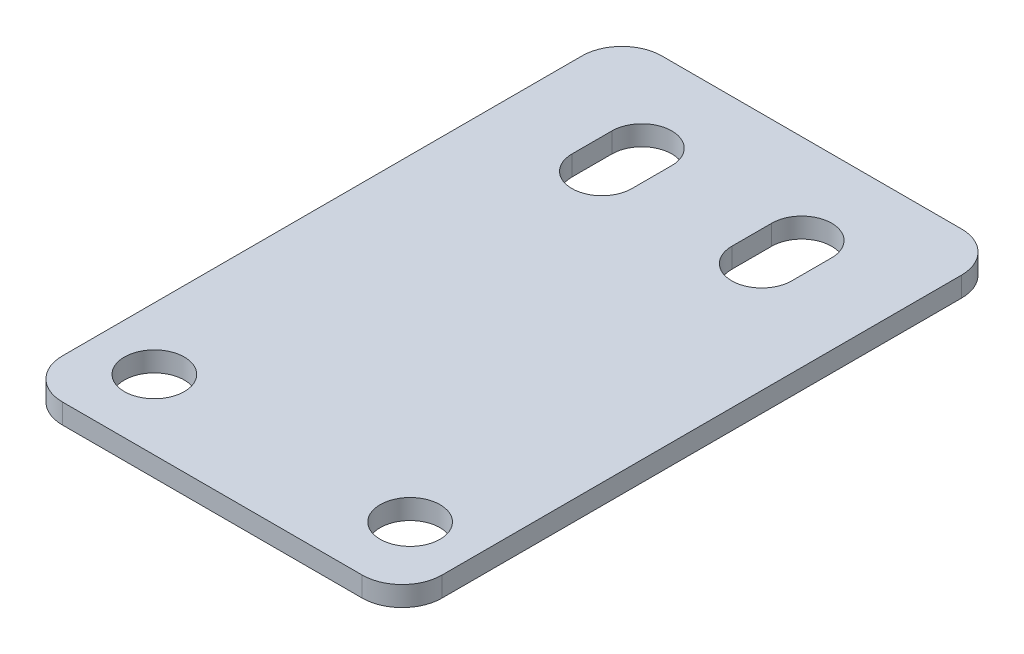
ISO-10303-21;
HEADER;
FILE_DESCRIPTION(('STEP AP214'),'2;1');
FILE_NAME('part.step','',(''),(''),'','','');
FILE_SCHEMA(('AUTOMOTIVE_DESIGN { 1 0 10303 214 1 1 1 1 }'));
ENDSEC;
DATA;
#1=APPLICATION_CONTEXT('core data for automotive mechanical design processes');
#2=APPLICATION_PROTOCOL_DEFINITION('international standard','automotive_design',2000,#1);
#3=PRODUCT_CONTEXT('',#1,'mechanical');
#4=PRODUCT('Part','Part','',(#3));
#5=PRODUCT_RELATED_PRODUCT_CATEGORY('part','',(#4));
#6=PRODUCT_DEFINITION_FORMATION('','',#4);
#7=PRODUCT_DEFINITION_CONTEXT('part definition',#1,'design');
#8=PRODUCT_DEFINITION('design','',#6,#7);
#9=PRODUCT_DEFINITION_SHAPE('','',#8);
#10=(LENGTH_UNIT() NAMED_UNIT(*) SI_UNIT(.MILLI.,.METRE.));
#11=(NAMED_UNIT(*) PLANE_ANGLE_UNIT() SI_UNIT($,.RADIAN.));
#12=(NAMED_UNIT(*) SI_UNIT($,.STERADIAN.) SOLID_ANGLE_UNIT());
#13=UNCERTAINTY_MEASURE_WITH_UNIT(LENGTH_MEASURE(1.E-05),#10,'distance_accuracy_value','');
#14=(GEOMETRIC_REPRESENTATION_CONTEXT(3) GLOBAL_UNCERTAINTY_ASSIGNED_CONTEXT((#13)) GLOBAL_UNIT_ASSIGNED_CONTEXT((#10,
#11,#12)) REPRESENTATION_CONTEXT('',''));
#15=CARTESIAN_POINT('',(0.,0.,0.));
#16=DIRECTION('',(0.,0.,1.));
#17=DIRECTION('',(1.,0.,0.));
#18=AXIS2_PLACEMENT_3D('',#15,#16,#17);
#19=CARTESIAN_POINT('',(9.50000000000001,-1.,-26.5));
#20=DIRECTION('',(0.,0.,-1.));
#21=DIRECTION('',(-1.,0.,0.));
#22=AXIS2_PLACEMENT_3D('',#19,#20,#21);
#23=PLANE('',#22);
#24=DIRECTION('',(-1.,0.,0.));
#25=VECTOR('',#24,1.);
#26=CARTESIAN_POINT('',(9.50000000000001,0.,-26.5));
#27=LINE('',#26,#25);
#28=CARTESIAN_POINT('',(7.50000000000001,0.,-26.5));
#29=VERTEX_POINT('',#28);
#30=CARTESIAN_POINT('',(-7.5,0.,-26.5));
#31=VERTEX_POINT('',#30);
#32=EDGE_CURVE('E237',#29,#31,#27,.T.);
#33=ORIENTED_EDGE('',*,*,#32,.F.);
#34=DIRECTION('',(0.,1.,0.));
#35=VECTOR('',#34,1.);
#36=CARTESIAN_POINT('',(7.50000000000001,-1.,-26.5));
#37=LINE('',#36,#35);
#38=CARTESIAN_POINT('',(7.50000000000001,-1.,-26.5));
#39=VERTEX_POINT('',#38);
#40=EDGE_CURVE('E11',#29,#39,#37,.F.);
#41=ORIENTED_EDGE('',*,*,#40,.T.);
#42=DIRECTION('',(-1.,0.,0.));
#43=VECTOR('',#42,1.);
#44=CARTESIAN_POINT('',(9.50000000000001,-1.,-26.5));
#45=LINE('',#44,#43);
#46=CARTESIAN_POINT('',(-7.5,-1.,-26.5));
#47=VERTEX_POINT('',#46);
#48=EDGE_CURVE('E240',#39,#47,#45,.T.);
#49=ORIENTED_EDGE('',*,*,#48,.T.);
#50=DIRECTION('',(0.,1.,0.));
#51=VECTOR('',#50,1.);
#52=CARTESIAN_POINT('',(-7.5,-1.,-26.5));
#53=LINE('',#52,#51);
#54=EDGE_CURVE('E46',#47,#31,#53,.T.);
#55=ORIENTED_EDGE('',*,*,#54,.T.);
#56=EDGE_LOOP('',(#33,#41,#49,#55));
#57=FACE_BOUND('',#56,.T.);
#58=ADVANCED_FACE('F38',(#57),#23,.T.);
#59=CARTESIAN_POINT('',(9.50000000000001,-1.,3.5));
#60=DIRECTION('',(1.,0.,0.));
#61=DIRECTION('',(0.,0.,-1.));
#62=AXIS2_PLACEMENT_3D('',#59,#60,#61);
#63=PLANE('',#62);
#64=DIRECTION('',(0.,0.,-1.));
#65=VECTOR('',#64,1.);
#66=CARTESIAN_POINT('',(9.50000000000001,0.,3.5));
#67=LINE('',#66,#65);
#68=CARTESIAN_POINT('',(9.50000000000001,0.,1.5));
#69=VERTEX_POINT('',#68);
#70=CARTESIAN_POINT('',(9.50000000000001,0.,-24.5));
#71=VERTEX_POINT('',#70);
#72=EDGE_CURVE('E244',#69,#71,#67,.T.);
#73=ORIENTED_EDGE('',*,*,#72,.F.);
#74=DIRECTION('',(0.,1.,0.));
#75=VECTOR('',#74,1.);
#76=CARTESIAN_POINT('',(9.50000000000001,-1.,1.5));
#77=LINE('',#76,#75);
#78=CARTESIAN_POINT('',(9.50000000000001,-1.,1.5));
#79=VERTEX_POINT('',#78);
#80=EDGE_CURVE('E60',#69,#79,#77,.F.);
#81=ORIENTED_EDGE('',*,*,#80,.T.);
#82=DIRECTION('',(0.,0.,-1.));
#83=VECTOR('',#82,1.);
#84=CARTESIAN_POINT('',(9.50000000000001,-1.,3.5));
#85=LINE('',#84,#83);
#86=CARTESIAN_POINT('',(9.50000000000001,-1.,-24.5));
#87=VERTEX_POINT('',#86);
#88=EDGE_CURVE('E250',#79,#87,#85,.T.);
#89=ORIENTED_EDGE('',*,*,#88,.T.);
#90=DIRECTION('',(0.,1.,0.));
#91=VECTOR('',#90,1.);
#92=CARTESIAN_POINT('',(9.50000000000001,-1.,-24.5));
#93=LINE('',#92,#91);
#94=EDGE_CURVE('E287',#87,#71,#93,.T.);
#95=ORIENTED_EDGE('',*,*,#94,.T.);
#96=EDGE_LOOP('',(#73,#81,#89,#95));
#97=FACE_BOUND('',#96,.T.);
#98=ADVANCED_FACE('F303',(#97),#63,.T.);
#99=CARTESIAN_POINT('',(-9.49999999999999,-1.,3.5));
#100=DIRECTION('',(0.,0.,1.));
#101=DIRECTION('',(1.,0.,0.));
#102=AXIS2_PLACEMENT_3D('',#99,#100,#101);
#103=PLANE('',#102);
#104=DIRECTION('',(1.,0.,0.));
#105=VECTOR('',#104,1.);
#106=CARTESIAN_POINT('',(-9.49999999999999,0.,3.5));
#107=LINE('',#106,#105);
#108=CARTESIAN_POINT('',(-7.49999999999999,0.,3.5));
#109=VERTEX_POINT('',#108);
#110=CARTESIAN_POINT('',(7.50000000000001,0.,3.5));
#111=VERTEX_POINT('',#110);
#112=EDGE_CURVE('E258',#109,#111,#107,.T.);
#113=ORIENTED_EDGE('',*,*,#112,.F.);
#114=DIRECTION('',(0.,1.,0.));
#115=VECTOR('',#114,1.);
#116=CARTESIAN_POINT('',(-7.49999999999999,-1.,3.5));
#117=LINE('',#116,#115);
#118=CARTESIAN_POINT('',(-7.49999999999999,-1.,3.5));
#119=VERTEX_POINT('',#118);
#120=EDGE_CURVE('E278',#109,#119,#117,.F.);
#121=ORIENTED_EDGE('',*,*,#120,.T.);
#122=DIRECTION('',(1.,0.,0.));
#123=VECTOR('',#122,1.);
#124=CARTESIAN_POINT('',(-9.49999999999999,-1.,3.5));
#125=LINE('',#124,#123);
#126=CARTESIAN_POINT('',(7.50000000000001,-1.,3.5));
#127=VERTEX_POINT('',#126);
#128=EDGE_CURVE('E247',#119,#127,#125,.T.);
#129=ORIENTED_EDGE('',*,*,#128,.T.);
#130=DIRECTION('',(0.,1.,0.));
#131=VECTOR('',#130,1.);
#132=CARTESIAN_POINT('',(7.50000000000001,-1.,3.5));
#133=LINE('',#132,#131);
#134=EDGE_CURVE('E275',#127,#111,#133,.T.);
#135=ORIENTED_EDGE('',*,*,#134,.T.);
#136=EDGE_LOOP('',(#113,#121,#129,#135));
#137=FACE_BOUND('',#136,.T.);
#138=ADVANCED_FACE('F311',(#137),#103,.T.);
#139=CARTESIAN_POINT('',(-9.5,-1.,-26.5));
#140=DIRECTION('',(-1.,0.,0.));
#141=DIRECTION('',(0.,0.,1.));
#142=AXIS2_PLACEMENT_3D('',#139,#140,#141);
#143=PLANE('',#142);
#144=DIRECTION('',(0.,0.,1.));
#145=VECTOR('',#144,1.);
#146=CARTESIAN_POINT('',(-9.5,-1.,-26.5));
#147=LINE('',#146,#145);
#148=CARTESIAN_POINT('',(-9.5,-1.,-24.5));
#149=VERTEX_POINT('',#148);
#150=CARTESIAN_POINT('',(-9.49999999999999,-1.,1.49999999999999));
#151=VERTEX_POINT('',#150);
#152=EDGE_CURVE('E243',#149,#151,#147,.T.);
#153=ORIENTED_EDGE('',*,*,#152,.T.);
#154=DIRECTION('',(0.,1.,0.));
#155=VECTOR('',#154,1.);
#156=CARTESIAN_POINT('',(-9.49999999999999,-1.,1.5));
#157=LINE('',#156,#155);
#158=CARTESIAN_POINT('',(-9.49999999999999,0.,1.49999999999999));
#159=VERTEX_POINT('',#158);
#160=EDGE_CURVE('E264',#151,#159,#157,.T.);
#161=ORIENTED_EDGE('',*,*,#160,.T.);
#162=DIRECTION('',(0.,0.,1.));
#163=VECTOR('',#162,1.);
#164=CARTESIAN_POINT('',(-9.5,0.,-26.5));
#165=LINE('',#164,#163);
#166=CARTESIAN_POINT('',(-9.5,0.,-24.5));
#167=VERTEX_POINT('',#166);
#168=EDGE_CURVE('E255',#167,#159,#165,.T.);
#169=ORIENTED_EDGE('',*,*,#168,.F.);
#170=DIRECTION('',(0.,1.,0.));
#171=VECTOR('',#170,1.);
#172=CARTESIAN_POINT('',(-9.5,-1.,-24.5));
#173=LINE('',#172,#171);
#174=EDGE_CURVE('E252',#167,#149,#173,.F.);
#175=ORIENTED_EDGE('',*,*,#174,.T.);
#176=EDGE_LOOP('',(#153,#161,#169,#175));
#177=FACE_BOUND('',#176,.T.);
#178=ADVANCED_FACE('F318',(#177),#143,.T.);
#179=CARTESIAN_POINT('',(0.,-1.,0.));
#180=DIRECTION('',(0.,1.,0.));
#181=DIRECTION('',(0.,0.,1.));
#182=AXIS2_PLACEMENT_3D('',#179,#180,#181);
#183=PLANE('',#182);
#184=DIRECTION('',(0.,0.,-1.));
#185=VECTOR('',#184,1.);
#186=CARTESIAN_POINT('',(5.5,-1.,-22.));
#187=LINE('',#186,#185);
#188=CARTESIAN_POINT('',(5.5,-1.,-20.));
#189=VERTEX_POINT('',#188);
#190=CARTESIAN_POINT('',(5.5,-1.,-22.));
#191=VERTEX_POINT('',#190);
#192=EDGE_CURVE('E164',#189,#191,#187,.T.);
#193=ORIENTED_EDGE('',*,*,#192,.T.);
#194=CARTESIAN_POINT('',(4.,-1.,-22.));
#195=DIRECTION('',(0.,1.,0.));
#196=DIRECTION('',(0.,0.,1.));
#197=AXIS2_PLACEMENT_3D('',#194,#195,#196);
#198=CIRCLE('',#197,1.5);
#199=CARTESIAN_POINT('',(2.5,-1.,-22.));
#200=VERTEX_POINT('',#199);
#201=EDGE_CURVE('E156',#191,#200,#198,.T.);
#202=ORIENTED_EDGE('',*,*,#201,.T.);
#203=DIRECTION('',(0.,0.,1.));
#204=VECTOR('',#203,1.);
#205=CARTESIAN_POINT('',(2.5,-1.,-22.));
#206=LINE('',#205,#204);
#207=CARTESIAN_POINT('',(2.5,-1.,-20.));
#208=VERTEX_POINT('',#207);
#209=EDGE_CURVE('E168',#200,#208,#206,.T.);
#210=ORIENTED_EDGE('',*,*,#209,.T.);
#211=CARTESIAN_POINT('',(4.,-1.,-20.));
#212=DIRECTION('',(0.,1.,0.));
#213=DIRECTION('',(0.,0.,1.));
#214=AXIS2_PLACEMENT_3D('',#211,#212,#213);
#215=CIRCLE('',#214,1.5);
#216=EDGE_CURVE('E172',#208,#189,#215,.T.);
#217=ORIENTED_EDGE('',*,*,#216,.T.);
#218=EDGE_LOOP('',(#193,#202,#210,#217));
#219=FACE_BOUND('',#218,.T.);
#220=DIRECTION('',(0.,0.,-1.));
#221=VECTOR('',#220,1.);
#222=CARTESIAN_POINT('',(-2.5,-1.,-22.));
#223=LINE('',#222,#221);
#224=CARTESIAN_POINT('',(-2.5,-1.,-20.));
#225=VERTEX_POINT('',#224);
#226=CARTESIAN_POINT('',(-2.5,-1.,-22.));
#227=VERTEX_POINT('',#226);
#228=EDGE_CURVE('E206',#225,#227,#223,.T.);
#229=ORIENTED_EDGE('',*,*,#228,.T.);
#230=CARTESIAN_POINT('',(-4.,-1.,-22.));
#231=DIRECTION('',(0.,1.,0.));
#232=DIRECTION('',(0.,0.,1.));
#233=AXIS2_PLACEMENT_3D('',#230,#231,#232);
#234=CIRCLE('',#233,1.5);
#235=CARTESIAN_POINT('',(-5.5,-1.,-22.));
#236=VERTEX_POINT('',#235);
#237=EDGE_CURVE('E196',#227,#236,#234,.T.);
#238=ORIENTED_EDGE('',*,*,#237,.T.);
#239=DIRECTION('',(0.,0.,1.));
#240=VECTOR('',#239,1.);
#241=CARTESIAN_POINT('',(-5.5,-1.,-22.));
#242=LINE('',#241,#240);
#243=CARTESIAN_POINT('',(-5.5,-1.,-20.));
#244=VERTEX_POINT('',#243);
#245=EDGE_CURVE('E199',#236,#244,#242,.T.);
#246=ORIENTED_EDGE('',*,*,#245,.T.);
#247=CARTESIAN_POINT('',(-4.,-1.,-20.));
#248=DIRECTION('',(0.,1.,0.));
#249=DIRECTION('',(0.,0.,1.));
#250=AXIS2_PLACEMENT_3D('',#247,#248,#249);
#251=CIRCLE('',#250,1.5);
#252=EDGE_CURVE('E203',#244,#225,#251,.T.);
#253=ORIENTED_EDGE('',*,*,#252,.T.);
#254=EDGE_LOOP('',(#229,#238,#246,#253));
#255=FACE_BOUND('',#254,.T.);
#256=CARTESIAN_POINT('',(6.40000000000001,-1.,0.));
#257=DIRECTION('',(0.,1.,0.));
#258=DIRECTION('',(0.,0.,1.));
#259=AXIS2_PLACEMENT_3D('',#256,#257,#258);
#260=CIRCLE('',#259,1.5);
#261=CARTESIAN_POINT('',(6.40000000000001,-1.,1.5));
#262=VERTEX_POINT('',#261);
#263=EDGE_CURVE('E228',#262,#262,#260,.T.);
#264=ORIENTED_EDGE('',*,*,#263,.T.);
#265=EDGE_LOOP('',(#264));
#266=FACE_BOUND('',#265,.T.);
#267=CARTESIAN_POINT('',(-6.4,-1.,0.));
#268=DIRECTION('',(0.,1.,0.));
#269=DIRECTION('',(0.,0.,1.));
#270=AXIS2_PLACEMENT_3D('',#267,#268,#269);
#271=CIRCLE('',#270,1.5);
#272=CARTESIAN_POINT('',(-6.4,-1.,1.5));
#273=VERTEX_POINT('',#272);
#274=EDGE_CURVE('E234',#273,#273,#271,.T.);
#275=ORIENTED_EDGE('',*,*,#274,.T.);
#276=EDGE_LOOP('',(#275));
#277=FACE_BOUND('',#276,.T.);
#278=ORIENTED_EDGE('',*,*,#128,.F.);
#279=CARTESIAN_POINT('',(-7.49999999999999,-1.,1.5));
#280=DIRECTION('',(0.,1.,0.));
#281=DIRECTION('',(0.,0.,1.));
#282=AXIS2_PLACEMENT_3D('',#279,#280,#281);
#283=CIRCLE('',#282,2.);
#284=EDGE_CURVE('E285',#119,#151,#283,.F.);
#285=ORIENTED_EDGE('',*,*,#284,.T.);
#286=ORIENTED_EDGE('',*,*,#152,.F.);
#287=CARTESIAN_POINT('',(-7.5,-1.,-24.5));
#288=DIRECTION('',(0.,1.,0.));
#289=DIRECTION('',(0.,0.,1.));
#290=AXIS2_PLACEMENT_3D('',#287,#288,#289);
#291=CIRCLE('',#290,2.);
#292=EDGE_CURVE('E280',#149,#47,#291,.F.);
#293=ORIENTED_EDGE('',*,*,#292,.T.);
#294=ORIENTED_EDGE('',*,*,#48,.F.);
#295=CARTESIAN_POINT('',(7.50000000000001,-1.,-24.5));
#296=DIRECTION('',(0.,1.,0.));
#297=DIRECTION('',(0.,0.,1.));
#298=AXIS2_PLACEMENT_3D('',#295,#296,#297);
#299=CIRCLE('',#298,2.);
#300=EDGE_CURVE('E53',#39,#87,#299,.F.);
#301=ORIENTED_EDGE('',*,*,#300,.T.);
#302=ORIENTED_EDGE('',*,*,#88,.F.);
#303=CARTESIAN_POINT('',(7.50000000000001,-1.,1.5));
#304=DIRECTION('',(0.,1.,0.));
#305=DIRECTION('',(0.,0.,1.));
#306=AXIS2_PLACEMENT_3D('',#303,#304,#305);
#307=CIRCLE('',#306,2.);
#308=EDGE_CURVE('E283',#79,#127,#307,.F.);
#309=ORIENTED_EDGE('',*,*,#308,.T.);
#310=EDGE_LOOP('',(#278,#285,#286,#293,#294,#301,#302,#309));
#311=FACE_BOUND('',#310,.T.);
#312=ADVANCED_FACE('F174',(#219,#255,#266,#277,#311),#183,.F.);
#313=CARTESIAN_POINT('',(0.,0.,0.));
#314=DIRECTION('',(0.,1.,0.));
#315=DIRECTION('',(0.,0.,1.));
#316=AXIS2_PLACEMENT_3D('',#313,#314,#315);
#317=PLANE('',#316);
#318=CARTESIAN_POINT('',(4.,0.,-22.));
#319=DIRECTION('',(0.,1.,0.));
#320=DIRECTION('',(0.,0.,1.));
#321=AXIS2_PLACEMENT_3D('',#318,#319,#320);
#322=CIRCLE('',#321,1.5);
#323=CARTESIAN_POINT('',(5.5,0.,-22.));
#324=VERTEX_POINT('',#323);
#325=CARTESIAN_POINT('',(2.5,0.,-22.));
#326=VERTEX_POINT('',#325);
#327=EDGE_CURVE('E159',#324,#326,#322,.T.);
#328=ORIENTED_EDGE('',*,*,#327,.F.);
#329=DIRECTION('',(0.,0.,-1.));
#330=VECTOR('',#329,1.);
#331=CARTESIAN_POINT('',(5.5,0.,-22.));
#332=LINE('',#331,#330);
#333=CARTESIAN_POINT('',(5.5,0.,-20.));
#334=VERTEX_POINT('',#333);
#335=EDGE_CURVE('E177',#334,#324,#332,.T.);
#336=ORIENTED_EDGE('',*,*,#335,.F.);
#337=CARTESIAN_POINT('',(4.,0.,-20.));
#338=DIRECTION('',(0.,1.,0.));
#339=DIRECTION('',(0.,0.,1.));
#340=AXIS2_PLACEMENT_3D('',#337,#338,#339);
#341=CIRCLE('',#340,1.5);
#342=CARTESIAN_POINT('',(2.5,0.,-20.));
#343=VERTEX_POINT('',#342);
#344=EDGE_CURVE('E180',#343,#334,#341,.T.);
#345=ORIENTED_EDGE('',*,*,#344,.F.);
#346=DIRECTION('',(0.,0.,1.));
#347=VECTOR('',#346,1.);
#348=CARTESIAN_POINT('',(2.5,0.,-22.));
#349=LINE('',#348,#347);
#350=EDGE_CURVE('E186',#326,#343,#349,.T.);
#351=ORIENTED_EDGE('',*,*,#350,.F.);
#352=EDGE_LOOP('',(#328,#336,#345,#351));
#353=FACE_BOUND('',#352,.T.);
#354=CARTESIAN_POINT('',(-4.,0.,-22.));
#355=DIRECTION('',(0.,1.,0.));
#356=DIRECTION('',(0.,0.,1.));
#357=AXIS2_PLACEMENT_3D('',#354,#355,#356);
#358=CIRCLE('',#357,1.5);
#359=CARTESIAN_POINT('',(-2.5,0.,-22.));
#360=VERTEX_POINT('',#359);
#361=CARTESIAN_POINT('',(-5.5,0.,-22.));
#362=VERTEX_POINT('',#361);
#363=EDGE_CURVE('E192',#360,#362,#358,.T.);
#364=ORIENTED_EDGE('',*,*,#363,.F.);
#365=DIRECTION('',(0.,0.,-1.));
#366=VECTOR('',#365,1.);
#367=CARTESIAN_POINT('',(-2.5,0.,-22.));
#368=LINE('',#367,#366);
#369=CARTESIAN_POINT('',(-2.5,0.,-20.));
#370=VERTEX_POINT('',#369);
#371=EDGE_CURVE('E200',#370,#360,#368,.T.);
#372=ORIENTED_EDGE('',*,*,#371,.F.);
#373=CARTESIAN_POINT('',(-4.,0.,-20.));
#374=DIRECTION('',(0.,1.,0.));
#375=DIRECTION('',(0.,0.,1.));
#376=AXIS2_PLACEMENT_3D('',#373,#374,#375);
#377=CIRCLE('',#376,1.5);
#378=CARTESIAN_POINT('',(-5.5,0.,-20.));
#379=VERTEX_POINT('',#378);
#380=EDGE_CURVE('E214',#379,#370,#377,.T.);
#381=ORIENTED_EDGE('',*,*,#380,.F.);
#382=DIRECTION('',(0.,0.,1.));
#383=VECTOR('',#382,1.);
#384=CARTESIAN_POINT('',(-5.5,0.,-22.));
#385=LINE('',#384,#383);
#386=EDGE_CURVE('E211',#362,#379,#385,.T.);
#387=ORIENTED_EDGE('',*,*,#386,.F.);
#388=EDGE_LOOP('',(#364,#372,#381,#387));
#389=FACE_BOUND('',#388,.T.);
#390=CARTESIAN_POINT('',(6.40000000000001,0.,0.));
#391=DIRECTION('',(0.,1.,0.));
#392=DIRECTION('',(0.,0.,1.));
#393=AXIS2_PLACEMENT_3D('',#390,#391,#392);
#394=CIRCLE('',#393,1.5);
#395=CARTESIAN_POINT('',(6.40000000000001,0.,1.5));
#396=VERTEX_POINT('',#395);
#397=EDGE_CURVE('E221',#396,#396,#394,.T.);
#398=ORIENTED_EDGE('',*,*,#397,.F.);
#399=EDGE_LOOP('',(#398));
#400=FACE_BOUND('',#399,.T.);
#401=CARTESIAN_POINT('',(-6.4,0.,0.));
#402=DIRECTION('',(0.,1.,0.));
#403=DIRECTION('',(0.,0.,1.));
#404=AXIS2_PLACEMENT_3D('',#401,#402,#403);
#405=CIRCLE('',#404,1.5);
#406=CARTESIAN_POINT('',(-6.4,0.,1.5));
#407=VERTEX_POINT('',#406);
#408=EDGE_CURVE('E231',#407,#407,#405,.T.);
#409=ORIENTED_EDGE('',*,*,#408,.F.);
#410=EDGE_LOOP('',(#409));
#411=FACE_BOUND('',#410,.T.);
#412=ORIENTED_EDGE('',*,*,#168,.T.);
#413=CARTESIAN_POINT('',(-7.49999999999999,0.,1.5));
#414=DIRECTION('',(0.,1.,0.));
#415=DIRECTION('',(0.,0.,1.));
#416=AXIS2_PLACEMENT_3D('',#413,#414,#415);
#417=CIRCLE('',#416,2.);
#418=EDGE_CURVE('E273',#159,#109,#417,.T.);
#419=ORIENTED_EDGE('',*,*,#418,.T.);
#420=ORIENTED_EDGE('',*,*,#112,.T.);
#421=CARTESIAN_POINT('',(7.50000000000001,0.,1.5));
#422=DIRECTION('',(0.,1.,0.));
#423=DIRECTION('',(0.,0.,1.));
#424=AXIS2_PLACEMENT_3D('',#421,#422,#423);
#425=CIRCLE('',#424,2.);
#426=EDGE_CURVE('E271',#111,#69,#425,.T.);
#427=ORIENTED_EDGE('',*,*,#426,.T.);
#428=ORIENTED_EDGE('',*,*,#72,.T.);
#429=CARTESIAN_POINT('',(7.50000000000001,0.,-24.5));
#430=DIRECTION('',(0.,1.,0.));
#431=DIRECTION('',(0.,0.,1.));
#432=AXIS2_PLACEMENT_3D('',#429,#430,#431);
#433=CIRCLE('',#432,2.);
#434=EDGE_CURVE('E269',#71,#29,#433,.T.);
#435=ORIENTED_EDGE('',*,*,#434,.T.);
#436=ORIENTED_EDGE('',*,*,#32,.T.);
#437=CARTESIAN_POINT('',(-7.5,0.,-24.5));
#438=DIRECTION('',(0.,1.,0.));
#439=DIRECTION('',(0.,0.,1.));
#440=AXIS2_PLACEMENT_3D('',#437,#438,#439);
#441=CIRCLE('',#440,2.);
#442=EDGE_CURVE('E267',#31,#167,#441,.T.);
#443=ORIENTED_EDGE('',*,*,#442,.T.);
#444=EDGE_LOOP('',(#412,#419,#420,#427,#428,#435,#436,#443));
#445=FACE_BOUND('',#444,.T.);
#446=ADVANCED_FACE('F298',(#353,#389,#400,#411,#445),#317,.T.);
#447=CARTESIAN_POINT('',(-6.4,-1.,0.));
#448=DIRECTION('',(0.,1.,0.));
#449=DIRECTION('',(0.,0.,1.));
#450=AXIS2_PLACEMENT_3D('',#447,#448,#449);
#451=CYLINDRICAL_SURFACE('',#450,1.5);
#452=ORIENTED_EDGE('',*,*,#274,.F.);
#453=EDGE_LOOP('',(#452));
#454=FACE_BOUND('',#453,.T.);
#455=ORIENTED_EDGE('',*,*,#408,.T.);
#456=EDGE_LOOP('',(#455));
#457=FACE_BOUND('',#456,.T.);
#458=ADVANCED_FACE('F452',(#454,#457),#451,.F.);
#459=CARTESIAN_POINT('',(6.40000000000001,-1.,0.));
#460=DIRECTION('',(0.,1.,0.));
#461=DIRECTION('',(0.,0.,1.));
#462=AXIS2_PLACEMENT_3D('',#459,#460,#461);
#463=CYLINDRICAL_SURFACE('',#462,1.5);
#464=ORIENTED_EDGE('',*,*,#263,.F.);
#465=EDGE_LOOP('',(#464));
#466=FACE_BOUND('',#465,.T.);
#467=ORIENTED_EDGE('',*,*,#397,.T.);
#468=EDGE_LOOP('',(#467));
#469=FACE_BOUND('',#468,.T.);
#470=ADVANCED_FACE('F441',(#466,#469),#463,.F.);
#471=CARTESIAN_POINT('',(-4.,-1.,-22.));
#472=DIRECTION('',(0.,1.,0.));
#473=DIRECTION('',(0.,0.,1.));
#474=AXIS2_PLACEMENT_3D('',#471,#472,#473);
#475=CYLINDRICAL_SURFACE('',#474,1.5);
#476=ORIENTED_EDGE('',*,*,#363,.T.);
#477=DIRECTION('',(0.,1.,0.));
#478=VECTOR('',#477,1.);
#479=CARTESIAN_POINT('',(-5.5,-1.,-22.));
#480=LINE('',#479,#478);
#481=EDGE_CURVE('E209',#236,#362,#480,.T.);
#482=ORIENTED_EDGE('',*,*,#481,.F.);
#483=ORIENTED_EDGE('',*,*,#237,.F.);
#484=DIRECTION('',(0.,1.,0.));
#485=VECTOR('',#484,1.);
#486=CARTESIAN_POINT('',(-2.5,-1.,-22.));
#487=LINE('',#486,#485);
#488=EDGE_CURVE('E219',#227,#360,#487,.T.);
#489=ORIENTED_EDGE('',*,*,#488,.T.);
#490=EDGE_LOOP('',(#476,#482,#483,#489));
#491=FACE_BOUND('',#490,.T.);
#492=ADVANCED_FACE('F430',(#491),#475,.F.);
#493=CARTESIAN_POINT('',(-2.5,-1.,-22.));
#494=DIRECTION('',(1.,0.,0.));
#495=DIRECTION('',(0.,0.,-1.));
#496=AXIS2_PLACEMENT_3D('',#493,#494,#495);
#497=PLANE('',#496);
#498=ORIENTED_EDGE('',*,*,#371,.T.);
#499=ORIENTED_EDGE('',*,*,#488,.F.);
#500=ORIENTED_EDGE('',*,*,#228,.F.);
#501=DIRECTION('',(0.,1.,0.));
#502=VECTOR('',#501,1.);
#503=CARTESIAN_POINT('',(-2.5,-1.,-20.));
#504=LINE('',#503,#502);
#505=EDGE_CURVE('E222',#225,#370,#504,.T.);
#506=ORIENTED_EDGE('',*,*,#505,.T.);
#507=EDGE_LOOP('',(#498,#499,#500,#506));
#508=FACE_BOUND('',#507,.T.);
#509=ADVANCED_FACE('F419',(#508),#497,.F.);
#510=CARTESIAN_POINT('',(-4.,-1.,-20.));
#511=DIRECTION('',(0.,1.,0.));
#512=DIRECTION('',(0.,0.,1.));
#513=AXIS2_PLACEMENT_3D('',#510,#511,#512);
#514=CYLINDRICAL_SURFACE('',#513,1.5);
#515=ORIENTED_EDGE('',*,*,#380,.T.);
#516=ORIENTED_EDGE('',*,*,#505,.F.);
#517=ORIENTED_EDGE('',*,*,#252,.F.);
#518=DIRECTION('',(0.,1.,0.));
#519=VECTOR('',#518,1.);
#520=CARTESIAN_POINT('',(-5.5,-1.,-20.));
#521=LINE('',#520,#519);
#522=EDGE_CURVE('E224',#244,#379,#521,.T.);
#523=ORIENTED_EDGE('',*,*,#522,.T.);
#524=EDGE_LOOP('',(#515,#516,#517,#523));
#525=FACE_BOUND('',#524,.T.);
#526=ADVANCED_FACE('F408',(#525),#514,.F.);
#527=CARTESIAN_POINT('',(-5.5,-1.,-22.));
#528=DIRECTION('',(-1.,0.,0.));
#529=DIRECTION('',(0.,0.,1.));
#530=AXIS2_PLACEMENT_3D('',#527,#528,#529);
#531=PLANE('',#530);
#532=ORIENTED_EDGE('',*,*,#386,.T.);
#533=ORIENTED_EDGE('',*,*,#522,.F.);
#534=ORIENTED_EDGE('',*,*,#245,.F.);
#535=ORIENTED_EDGE('',*,*,#481,.T.);
#536=EDGE_LOOP('',(#532,#533,#534,#535));
#537=FACE_BOUND('',#536,.T.);
#538=ADVANCED_FACE('F398',(#537),#531,.F.);
#539=CARTESIAN_POINT('',(4.,-1.,-22.));
#540=DIRECTION('',(0.,1.,0.));
#541=DIRECTION('',(0.,0.,1.));
#542=AXIS2_PLACEMENT_3D('',#539,#540,#541);
#543=CYLINDRICAL_SURFACE('',#542,1.5);
#544=ORIENTED_EDGE('',*,*,#327,.T.);
#545=DIRECTION('',(0.,1.,0.));
#546=VECTOR('',#545,1.);
#547=CARTESIAN_POINT('',(2.5,-1.,-22.));
#548=LINE('',#547,#546);
#549=EDGE_CURVE('E152',#200,#326,#548,.T.);
#550=ORIENTED_EDGE('',*,*,#549,.F.);
#551=ORIENTED_EDGE('',*,*,#201,.F.);
#552=DIRECTION('',(0.,1.,0.));
#553=VECTOR('',#552,1.);
#554=CARTESIAN_POINT('',(5.5,-1.,-22.));
#555=LINE('',#554,#553);
#556=EDGE_CURVE('E190',#191,#324,#555,.T.);
#557=ORIENTED_EDGE('',*,*,#556,.T.);
#558=EDGE_LOOP('',(#544,#550,#551,#557));
#559=FACE_BOUND('',#558,.T.);
#560=ADVANCED_FACE('F154',(#559),#543,.F.);
#561=CARTESIAN_POINT('',(5.5,-1.,-22.));
#562=DIRECTION('',(1.,0.,0.));
#563=DIRECTION('',(0.,0.,-1.));
#564=AXIS2_PLACEMENT_3D('',#561,#562,#563);
#565=PLANE('',#564);
#566=ORIENTED_EDGE('',*,*,#335,.T.);
#567=ORIENTED_EDGE('',*,*,#556,.F.);
#568=ORIENTED_EDGE('',*,*,#192,.F.);
#569=DIRECTION('',(0.,1.,0.));
#570=VECTOR('',#569,1.);
#571=CARTESIAN_POINT('',(5.5,-1.,-20.));
#572=LINE('',#571,#570);
#573=EDGE_CURVE('E193',#189,#334,#572,.T.);
#574=ORIENTED_EDGE('',*,*,#573,.T.);
#575=EDGE_LOOP('',(#566,#567,#568,#574));
#576=FACE_BOUND('',#575,.T.);
#577=ADVANCED_FACE('F377',(#576),#565,.F.);
#578=CARTESIAN_POINT('',(4.,-1.,-20.));
#579=DIRECTION('',(0.,1.,0.));
#580=DIRECTION('',(0.,0.,1.));
#581=AXIS2_PLACEMENT_3D('',#578,#579,#580);
#582=CYLINDRICAL_SURFACE('',#581,1.5);
#583=ORIENTED_EDGE('',*,*,#344,.T.);
#584=ORIENTED_EDGE('',*,*,#573,.F.);
#585=ORIENTED_EDGE('',*,*,#216,.F.);
#586=DIRECTION('',(0.,1.,0.));
#587=VECTOR('',#586,1.);
#588=CARTESIAN_POINT('',(2.5,-1.,-20.));
#589=LINE('',#588,#587);
#590=EDGE_CURVE('E163',#208,#343,#589,.T.);
#591=ORIENTED_EDGE('',*,*,#590,.T.);
#592=EDGE_LOOP('',(#583,#584,#585,#591));
#593=FACE_BOUND('',#592,.T.);
#594=ADVANCED_FACE('F367',(#593),#582,.F.);
#595=CARTESIAN_POINT('',(2.5,-1.,-22.));
#596=DIRECTION('',(-1.,0.,0.));
#597=DIRECTION('',(0.,0.,1.));
#598=AXIS2_PLACEMENT_3D('',#595,#596,#597);
#599=PLANE('',#598);
#600=ORIENTED_EDGE('',*,*,#350,.T.);
#601=ORIENTED_EDGE('',*,*,#590,.F.);
#602=ORIENTED_EDGE('',*,*,#209,.F.);
#603=ORIENTED_EDGE('',*,*,#549,.T.);
#604=EDGE_LOOP('',(#600,#601,#602,#603));
#605=FACE_BOUND('',#604,.T.);
#606=ADVANCED_FACE('F169',(#605),#599,.F.);
#607=CARTESIAN_POINT('',(-7.49999999999999,-1.,1.5));
#608=DIRECTION('',(0.,1.,0.));
#609=DIRECTION('',(0.,0.,1.));
#610=AXIS2_PLACEMENT_3D('',#607,#608,#609);
#611=CYLINDRICAL_SURFACE('',#610,2.);
#612=ORIENTED_EDGE('',*,*,#284,.F.);
#613=ORIENTED_EDGE('',*,*,#120,.F.);
#614=ORIENTED_EDGE('',*,*,#418,.F.);
#615=ORIENTED_EDGE('',*,*,#160,.F.);
#616=EDGE_LOOP('',(#612,#613,#614,#615));
#617=FACE_BOUND('',#616,.T.);
#618=ADVANCED_FACE('F316',(#617),#611,.T.);
#619=CARTESIAN_POINT('',(7.50000000000001,-1.,1.5));
#620=DIRECTION('',(0.,1.,0.));
#621=DIRECTION('',(0.,0.,1.));
#622=AXIS2_PLACEMENT_3D('',#619,#620,#621);
#623=CYLINDRICAL_SURFACE('',#622,2.);
#624=ORIENTED_EDGE('',*,*,#308,.F.);
#625=ORIENTED_EDGE('',*,*,#80,.F.);
#626=ORIENTED_EDGE('',*,*,#426,.F.);
#627=ORIENTED_EDGE('',*,*,#134,.F.);
#628=EDGE_LOOP('',(#624,#625,#626,#627));
#629=FACE_BOUND('',#628,.T.);
#630=ADVANCED_FACE('F308',(#629),#623,.T.);
#631=CARTESIAN_POINT('',(7.50000000000001,-1.,-24.5));
#632=DIRECTION('',(0.,1.,0.));
#633=DIRECTION('',(0.,0.,1.));
#634=AXIS2_PLACEMENT_3D('',#631,#632,#633);
#635=CYLINDRICAL_SURFACE('',#634,2.);
#636=ORIENTED_EDGE('',*,*,#300,.F.);
#637=ORIENTED_EDGE('',*,*,#40,.F.);
#638=ORIENTED_EDGE('',*,*,#434,.F.);
#639=ORIENTED_EDGE('',*,*,#94,.F.);
#640=EDGE_LOOP('',(#636,#637,#638,#639));
#641=FACE_BOUND('',#640,.T.);
#642=ADVANCED_FACE('F302',(#641),#635,.T.);
#643=CARTESIAN_POINT('',(-7.5,-1.,-24.5));
#644=DIRECTION('',(0.,1.,0.));
#645=DIRECTION('',(0.,0.,1.));
#646=AXIS2_PLACEMENT_3D('',#643,#644,#645);
#647=CYLINDRICAL_SURFACE('',#646,2.);
#648=ORIENTED_EDGE('',*,*,#292,.F.);
#649=ORIENTED_EDGE('',*,*,#174,.F.);
#650=ORIENTED_EDGE('',*,*,#442,.F.);
#651=ORIENTED_EDGE('',*,*,#54,.F.);
#652=EDGE_LOOP('',(#648,#649,#650,#651));
#653=FACE_BOUND('',#652,.T.);
#654=ADVANCED_FACE('F40',(#653),#647,.T.);
#655=CLOSED_SHELL('',(#58,#98,#138,#178,#312,#446,#458,#470,#492,#509,#526,#538,#560,#577,#594,
#606,#618,#630,#642,#654));
#656=MANIFOLD_SOLID_BREP('B2',#655);
#657=ADVANCED_BREP_SHAPE_REPRESENTATION('',(#18,#656),#14);
#658=SHAPE_DEFINITION_REPRESENTATION(#9,#657);
ENDSEC;
END-ISO-10303-21;
